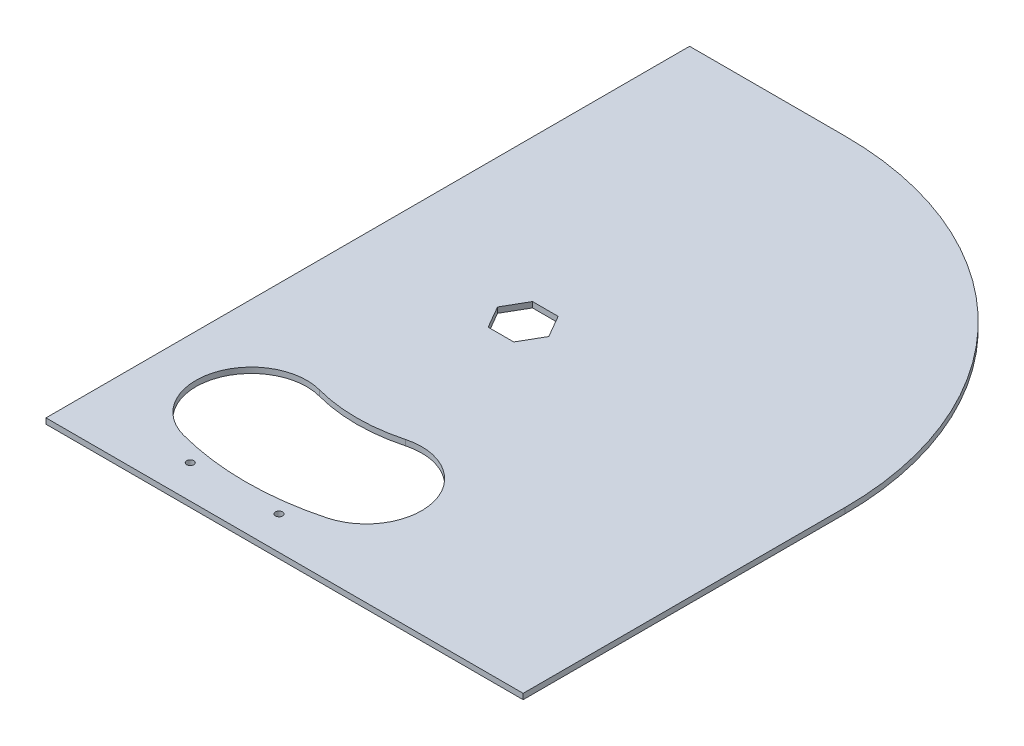
ISO-10303-21;
HEADER;
FILE_DESCRIPTION(('STEP AP214'),'2;1');
FILE_NAME('part.step','',(''),(''),'','','');
FILE_SCHEMA(('AUTOMOTIVE_DESIGN { 1 0 10303 214 1 1 1 1 }'));
ENDSEC;
DATA;
#1=APPLICATION_CONTEXT('core data for automotive mechanical design processes');
#2=APPLICATION_PROTOCOL_DEFINITION('international standard','automotive_design',2000,#1);
#3=PRODUCT_CONTEXT('',#1,'mechanical');
#4=PRODUCT('Part','Part','',(#3));
#5=PRODUCT_RELATED_PRODUCT_CATEGORY('part','',(#4));
#6=PRODUCT_DEFINITION_FORMATION('','',#4);
#7=PRODUCT_DEFINITION_CONTEXT('part definition',#1,'design');
#8=PRODUCT_DEFINITION('design','',#6,#7);
#9=PRODUCT_DEFINITION_SHAPE('','',#8);
#10=(LENGTH_UNIT() NAMED_UNIT(*) SI_UNIT(.MILLI.,.METRE.));
#11=(NAMED_UNIT(*) PLANE_ANGLE_UNIT() SI_UNIT($,.RADIAN.));
#12=(NAMED_UNIT(*) SI_UNIT($,.STERADIAN.) SOLID_ANGLE_UNIT());
#13=UNCERTAINTY_MEASURE_WITH_UNIT(LENGTH_MEASURE(1.E-05),#10,'distance_accuracy_value','');
#14=(GEOMETRIC_REPRESENTATION_CONTEXT(3) GLOBAL_UNCERTAINTY_ASSIGNED_CONTEXT((#13)) GLOBAL_UNIT_ASSIGNED_CONTEXT((#10,
#11,#12)) REPRESENTATION_CONTEXT('',''));
#15=CARTESIAN_POINT('',(0.,0.,0.));
#16=DIRECTION('',(0.,0.,1.));
#17=DIRECTION('',(1.,0.,0.));
#18=AXIS2_PLACEMENT_3D('',#15,#16,#17);
#19=CARTESIAN_POINT('',(0.,2.5,-145.));
#20=DIRECTION('',(0.,-1.,0.));
#21=DIRECTION('',(0.,0.,-1.));
#22=AXIS2_PLACEMENT_3D('',#19,#20,#21);
#23=PLANE('',#22);
#24=CARTESIAN_POINT('',(-20.,2.5,-15.));
#25=DIRECTION('',(0.,1.,0.));
#26=DIRECTION('',(0.,0.,1.));
#27=AXIS2_PLACEMENT_3D('',#24,#25,#26);
#28=CIRCLE('',#27,1.6);
#29=CARTESIAN_POINT('',(-20.,2.5,-13.4));
#30=VERTEX_POINT('',#29);
#31=EDGE_CURVE('E168',#30,#30,#28,.T.);
#32=ORIENTED_EDGE('',*,*,#31,.F.);
#33=EDGE_LOOP('',(#32));
#34=FACE_BOUND('',#33,.T.);
#35=DIRECTION('',(1.,0.,0.));
#36=VECTOR('',#35,1.);
#37=CARTESIAN_POINT('',(-5.77350269189624,2.5,-135.));
#38=LINE('',#37,#36);
#39=CARTESIAN_POINT('',(-5.77350269189624,2.5,-135.));
#40=VERTEX_POINT('',#39);
#41=CARTESIAN_POINT('',(5.77350269189626,2.5,-135.));
#42=VERTEX_POINT('',#41);
#43=EDGE_CURVE('E178',#40,#42,#38,.T.);
#44=ORIENTED_EDGE('',*,*,#43,.F.);
#45=DIRECTION('',(0.5,0.,0.866025403784438));
#46=VECTOR('',#45,1.);
#47=CARTESIAN_POINT('',(-11.5470053837925,2.5,-145.));
#48=LINE('',#47,#46);
#49=CARTESIAN_POINT('',(-11.5470053837925,2.5,-145.));
#50=VERTEX_POINT('',#49);
#51=EDGE_CURVE('E190',#50,#40,#48,.T.);
#52=ORIENTED_EDGE('',*,*,#51,.F.);
#53=DIRECTION('',(-0.5,0.,0.866025403784439));
#54=VECTOR('',#53,1.);
#55=CARTESIAN_POINT('',(-5.77350269189626,2.5,-155.));
#56=LINE('',#55,#54);
#57=CARTESIAN_POINT('',(-5.77350269189626,2.5,-155.));
#58=VERTEX_POINT('',#57);
#59=EDGE_CURVE('E187',#58,#50,#56,.T.);
#60=ORIENTED_EDGE('',*,*,#59,.F.);
#61=DIRECTION('',(-1.,0.,0.));
#62=VECTOR('',#61,1.);
#63=CARTESIAN_POINT('',(5.77350269189625,2.5,-155.));
#64=LINE('',#63,#62);
#65=CARTESIAN_POINT('',(5.77350269189625,2.5,-155.));
#66=VERTEX_POINT('',#65);
#67=EDGE_CURVE('E185',#66,#58,#64,.T.);
#68=ORIENTED_EDGE('',*,*,#67,.F.);
#69=DIRECTION('',(-0.5,0.,-0.866025403784439));
#70=VECTOR('',#69,1.);
#71=CARTESIAN_POINT('',(11.5470053837925,2.5,-145.));
#72=LINE('',#71,#70);
#73=CARTESIAN_POINT('',(11.5470053837925,2.5,-145.));
#74=VERTEX_POINT('',#73);
#75=EDGE_CURVE('E183',#74,#66,#72,.T.);
#76=ORIENTED_EDGE('',*,*,#75,.F.);
#77=DIRECTION('',(0.5,0.,-0.866025403784438));
#78=VECTOR('',#77,1.);
#79=CARTESIAN_POINT('',(5.77350269189626,2.5,-135.));
#80=LINE('',#79,#78);
#81=EDGE_CURVE('E180',#42,#74,#80,.T.);
#82=ORIENTED_EDGE('',*,*,#81,.F.);
#83=EDGE_LOOP('',(#44,#52,#60,#68,#76,#82));
#84=FACE_BOUND('',#83,.T.);
#85=DIRECTION('',(1.,0.,0.));
#86=VECTOR('',#85,1.);
#87=CARTESIAN_POINT('',(145.,2.5,0.));
#88=LINE('',#87,#86);
#89=CARTESIAN_POINT('',(-70.,2.5,0.));
#90=VERTEX_POINT('',#89);
#91=CARTESIAN_POINT('',(145.,2.5,0.));
#92=VERTEX_POINT('',#91);
#93=EDGE_CURVE('E223',#90,#92,#88,.T.);
#94=ORIENTED_EDGE('',*,*,#93,.T.);
#95=DIRECTION('',(0.,0.,-1.));
#96=VECTOR('',#95,1.);
#97=CARTESIAN_POINT('',(145.,2.5,-145.));
#98=LINE('',#97,#96);
#99=CARTESIAN_POINT('',(145.,2.5,-145.));
#100=VERTEX_POINT('',#99);
#101=EDGE_CURVE('E226',#92,#100,#98,.T.);
#102=ORIENTED_EDGE('',*,*,#101,.T.);
#103=CARTESIAN_POINT('',(0.,2.5,-145.));
#104=DIRECTION('',(0.,1.,0.));
#105=DIRECTION('',(0.,0.,-1.));
#106=AXIS2_PLACEMENT_3D('',#103,#104,#105);
#107=CIRCLE('',#106,145.);
#108=CARTESIAN_POINT('',(0.,2.5,-290.));
#109=VERTEX_POINT('',#108);
#110=EDGE_CURVE('E229',#100,#109,#107,.T.);
#111=ORIENTED_EDGE('',*,*,#110,.T.);
#112=DIRECTION('',(-1.,0.,0.));
#113=VECTOR('',#112,1.);
#114=CARTESIAN_POINT('',(0.,2.5,-290.));
#115=LINE('',#114,#113);
#116=CARTESIAN_POINT('',(-70.0000000000001,2.5,-290.));
#117=VERTEX_POINT('',#116);
#118=EDGE_CURVE('E231',#109,#117,#115,.T.);
#119=ORIENTED_EDGE('',*,*,#118,.T.);
#120=DIRECTION('',(0.,0.,1.));
#121=VECTOR('',#120,1.);
#122=CARTESIAN_POINT('',(-70.,2.5,0.));
#123=LINE('',#122,#121);
#124=EDGE_CURVE('E233',#117,#90,#123,.T.);
#125=ORIENTED_EDGE('',*,*,#124,.T.);
#126=EDGE_LOOP('',(#94,#102,#111,#119,#125));
#127=FACE_BOUND('',#126,.T.);
#128=CARTESIAN_POINT('',(-25.8819045102521,2.5,-48.4074173710932));
#129=DIRECTION('',(0.,1.,0.));
#130=DIRECTION('',(0.,0.,1.));
#131=AXIS2_PLACEMENT_3D('',#128,#129,#130);
#132=CIRCLE('',#131,25.);
#133=CARTESIAN_POINT('',(-19.4114283826891,2.5,-72.5555630283199));
#134=VERTEX_POINT('',#133);
#135=CARTESIAN_POINT('',(-32.3523806378152,2.5,-24.2592717138665));
#136=VERTEX_POINT('',#135);
#137=EDGE_CURVE('E139',#134,#136,#132,.T.);
#138=ORIENTED_EDGE('',*,*,#137,.F.);
#139=CARTESIAN_POINT('',(0.,2.5,-145.));
#140=DIRECTION('',(0.,-1.,0.));
#141=DIRECTION('',(0.,0.,1.));
#142=AXIS2_PLACEMENT_3D('',#139,#140,#141);
#143=CIRCLE('',#142,75.);
#144=CARTESIAN_POINT('',(19.4114283826891,2.5,-72.5555630283199));
#145=VERTEX_POINT('',#144);
#146=EDGE_CURVE('E162',#145,#134,#143,.T.);
#147=ORIENTED_EDGE('',*,*,#146,.F.);
#148=CARTESIAN_POINT('',(25.8819045102522,2.5,-48.4074173710932));
#149=DIRECTION('',(0.,1.,0.));
#150=DIRECTION('',(0.,0.,1.));
#151=AXIS2_PLACEMENT_3D('',#148,#149,#150);
#152=CIRCLE('',#151,25.);
#153=CARTESIAN_POINT('',(32.3523806378152,2.5,-24.2592717138665));
#154=VERTEX_POINT('',#153);
#155=EDGE_CURVE('E160',#154,#145,#152,.T.);
#156=ORIENTED_EDGE('',*,*,#155,.F.);
#157=CARTESIAN_POINT('',(0.,2.5,-145.));
#158=DIRECTION('',(0.,1.,0.));
#159=DIRECTION('',(0.,0.,1.));
#160=AXIS2_PLACEMENT_3D('',#157,#158,#159);
#161=CIRCLE('',#160,125.);
#162=EDGE_CURVE('E147',#136,#154,#161,.T.);
#163=ORIENTED_EDGE('',*,*,#162,.F.);
#164=EDGE_LOOP('',(#138,#147,#156,#163));
#165=FACE_BOUND('',#164,.T.);
#166=CARTESIAN_POINT('',(20.,2.5,-15.));
#167=DIRECTION('',(0.,1.,0.));
#168=DIRECTION('',(0.,0.,-1.));
#169=AXIS2_PLACEMENT_3D('',#166,#167,#168);
#170=CIRCLE('',#169,1.6);
#171=CARTESIAN_POINT('',(20.,2.5,-16.6));
#172=VERTEX_POINT('',#171);
#173=EDGE_CURVE('E343',#172,#172,#170,.T.);
#174=ORIENTED_EDGE('',*,*,#173,.F.);
#175=EDGE_LOOP('',(#174));
#176=FACE_BOUND('',#175,.T.);
#177=ADVANCED_FACE('F32',(#34,#84,#127,#165,#176),#23,.F.);
#178=CARTESIAN_POINT('',(0.,0.,-145.));
#179=DIRECTION('',(0.,-1.,0.));
#180=DIRECTION('',(0.,0.,-1.));
#181=AXIS2_PLACEMENT_3D('',#178,#179,#180);
#182=PLANE('',#181);
#183=CARTESIAN_POINT('',(-20.,0.,-15.));
#184=DIRECTION('',(0.,1.,0.));
#185=DIRECTION('',(0.,0.,1.));
#186=AXIS2_PLACEMENT_3D('',#183,#184,#185);
#187=CIRCLE('',#186,1.6);
#188=CARTESIAN_POINT('',(-20.,0.,-13.4));
#189=VERTEX_POINT('',#188);
#190=EDGE_CURVE('E349',#189,#189,#187,.T.);
#191=ORIENTED_EDGE('',*,*,#190,.T.);
#192=EDGE_LOOP('',(#191));
#193=FACE_BOUND('',#192,.T.);
#194=DIRECTION('',(0.5,0.,0.866025403784438));
#195=VECTOR('',#194,1.);
#196=CARTESIAN_POINT('',(-11.5470053837925,0.,-145.));
#197=LINE('',#196,#195);
#198=CARTESIAN_POINT('',(-11.5470053837925,0.,-145.));
#199=VERTEX_POINT('',#198);
#200=CARTESIAN_POINT('',(-5.77350269189623,0.,-135.));
#201=VERTEX_POINT('',#200);
#202=EDGE_CURVE('E181',#199,#201,#197,.T.);
#203=ORIENTED_EDGE('',*,*,#202,.T.);
#204=DIRECTION('',(1.,0.,0.));
#205=VECTOR('',#204,1.);
#206=CARTESIAN_POINT('',(-5.77350269189624,0.,-135.));
#207=LINE('',#206,#205);
#208=CARTESIAN_POINT('',(5.77350269189626,0.,-135.));
#209=VERTEX_POINT('',#208);
#210=EDGE_CURVE('E155',#201,#209,#207,.T.);
#211=ORIENTED_EDGE('',*,*,#210,.T.);
#212=DIRECTION('',(0.5,0.,-0.866025403784438));
#213=VECTOR('',#212,1.);
#214=CARTESIAN_POINT('',(5.77350269189626,0.,-135.));
#215=LINE('',#214,#213);
#216=CARTESIAN_POINT('',(11.5470053837925,0.,-145.));
#217=VERTEX_POINT('',#216);
#218=EDGE_CURVE('E195',#209,#217,#215,.T.);
#219=ORIENTED_EDGE('',*,*,#218,.T.);
#220=DIRECTION('',(-0.5,0.,-0.866025403784439));
#221=VECTOR('',#220,1.);
#222=CARTESIAN_POINT('',(11.5470053837925,0.,-145.));
#223=LINE('',#222,#221);
#224=CARTESIAN_POINT('',(5.77350269189625,0.,-155.));
#225=VERTEX_POINT('',#224);
#226=EDGE_CURVE('E198',#217,#225,#223,.T.);
#227=ORIENTED_EDGE('',*,*,#226,.T.);
#228=DIRECTION('',(-1.,0.,0.));
#229=VECTOR('',#228,1.);
#230=CARTESIAN_POINT('',(5.77350269189625,0.,-155.));
#231=LINE('',#230,#229);
#232=CARTESIAN_POINT('',(-5.77350269189626,0.,-155.));
#233=VERTEX_POINT('',#232);
#234=EDGE_CURVE('E201',#225,#233,#231,.T.);
#235=ORIENTED_EDGE('',*,*,#234,.T.);
#236=DIRECTION('',(-0.5,0.,0.866025403784439));
#237=VECTOR('',#236,1.);
#238=CARTESIAN_POINT('',(-5.77350269189626,0.,-155.));
#239=LINE('',#238,#237);
#240=EDGE_CURVE('E204',#233,#199,#239,.T.);
#241=ORIENTED_EDGE('',*,*,#240,.T.);
#242=EDGE_LOOP('',(#203,#211,#219,#227,#235,#241));
#243=FACE_BOUND('',#242,.T.);
#244=DIRECTION('',(0.,0.,-1.));
#245=VECTOR('',#244,1.);
#246=CARTESIAN_POINT('',(145.,0.,-145.));
#247=LINE('',#246,#245);
#248=CARTESIAN_POINT('',(145.,0.,0.));
#249=VERTEX_POINT('',#248);
#250=CARTESIAN_POINT('',(145.,0.,-145.));
#251=VERTEX_POINT('',#250);
#252=EDGE_CURVE('E222',#249,#251,#247,.T.);
#253=ORIENTED_EDGE('',*,*,#252,.F.);
#254=DIRECTION('',(1.,0.,0.));
#255=VECTOR('',#254,1.);
#256=CARTESIAN_POINT('',(0.,0.,0.));
#257=LINE('',#256,#255);
#258=CARTESIAN_POINT('',(-70.,0.,0.));
#259=VERTEX_POINT('',#258);
#260=EDGE_CURVE('E227',#259,#249,#257,.T.);
#261=ORIENTED_EDGE('',*,*,#260,.F.);
#262=DIRECTION('',(0.,0.,1.));
#263=VECTOR('',#262,1.);
#264=CARTESIAN_POINT('',(-70.,0.,0.));
#265=LINE('',#264,#263);
#266=CARTESIAN_POINT('',(-70.0000000000001,0.,-290.));
#267=VERTEX_POINT('',#266);
#268=EDGE_CURVE('E242',#267,#259,#265,.T.);
#269=ORIENTED_EDGE('',*,*,#268,.F.);
#270=DIRECTION('',(-1.,0.,0.));
#271=VECTOR('',#270,1.);
#272=CARTESIAN_POINT('',(0.,0.,-290.));
#273=LINE('',#272,#271);
#274=CARTESIAN_POINT('',(0.,0.,-290.));
#275=VERTEX_POINT('',#274);
#276=EDGE_CURVE('E240',#275,#267,#273,.T.);
#277=ORIENTED_EDGE('',*,*,#276,.F.);
#278=CARTESIAN_POINT('',(0.,0.,-145.));
#279=DIRECTION('',(0.,1.,0.));
#280=DIRECTION('',(0.,0.,-1.));
#281=AXIS2_PLACEMENT_3D('',#278,#279,#280);
#282=CIRCLE('',#281,145.);
#283=EDGE_CURVE('E238',#251,#275,#282,.T.);
#284=ORIENTED_EDGE('',*,*,#283,.F.);
#285=EDGE_LOOP('',(#253,#261,#269,#277,#284));
#286=FACE_BOUND('',#285,.T.);
#287=CARTESIAN_POINT('',(0.,0.,-145.));
#288=DIRECTION('',(0.,-1.,0.));
#289=DIRECTION('',(0.,0.,1.));
#290=AXIS2_PLACEMENT_3D('',#287,#288,#289);
#291=CIRCLE('',#290,75.);
#292=CARTESIAN_POINT('',(19.4114283826891,0.,-72.5555630283199));
#293=VERTEX_POINT('',#292);
#294=CARTESIAN_POINT('',(-19.4114283826891,0.,-72.5555630283199));
#295=VERTEX_POINT('',#294);
#296=EDGE_CURVE('E148',#293,#295,#291,.T.);
#297=ORIENTED_EDGE('',*,*,#296,.T.);
#298=CARTESIAN_POINT('',(-25.8819045102521,0.,-48.4074173710932));
#299=DIRECTION('',(0.,1.,0.));
#300=DIRECTION('',(0.,0.,1.));
#301=AXIS2_PLACEMENT_3D('',#298,#299,#300);
#302=CIRCLE('',#301,25.);
#303=CARTESIAN_POINT('',(-32.3523806378152,0.,-24.2592717138665));
#304=VERTEX_POINT('',#303);
#305=EDGE_CURVE('E55',#295,#304,#302,.T.);
#306=ORIENTED_EDGE('',*,*,#305,.T.);
#307=CARTESIAN_POINT('',(0.,0.,-145.));
#308=DIRECTION('',(0.,1.,0.));
#309=DIRECTION('',(0.,0.,1.));
#310=AXIS2_PLACEMENT_3D('',#307,#308,#309);
#311=CIRCLE('',#310,125.);
#312=CARTESIAN_POINT('',(32.3523806378152,0.,-24.2592717138665));
#313=VERTEX_POINT('',#312);
#314=EDGE_CURVE('E154',#304,#313,#311,.T.);
#315=ORIENTED_EDGE('',*,*,#314,.T.);
#316=CARTESIAN_POINT('',(25.8819045102522,0.,-48.4074173710932));
#317=DIRECTION('',(0.,1.,0.));
#318=DIRECTION('',(0.,0.,1.));
#319=AXIS2_PLACEMENT_3D('',#316,#317,#318);
#320=CIRCLE('',#319,25.);
#321=EDGE_CURVE('E170',#313,#293,#320,.T.);
#322=ORIENTED_EDGE('',*,*,#321,.T.);
#323=EDGE_LOOP('',(#297,#306,#315,#322));
#324=FACE_BOUND('',#323,.T.);
#325=CARTESIAN_POINT('',(20.,0.,-15.));
#326=DIRECTION('',(0.,1.,0.));
#327=DIRECTION('',(0.,0.,-1.));
#328=AXIS2_PLACEMENT_3D('',#325,#326,#327);
#329=CIRCLE('',#328,1.6);
#330=CARTESIAN_POINT('',(20.,0.,-16.6));
#331=VERTEX_POINT('',#330);
#332=EDGE_CURVE('E346',#331,#331,#329,.T.);
#333=ORIENTED_EDGE('',*,*,#332,.T.);
#334=EDGE_LOOP('',(#333));
#335=FACE_BOUND('',#334,.T.);
#336=ADVANCED_FACE('F263',(#193,#243,#286,#324,#335),#182,.T.);
#337=CARTESIAN_POINT('',(145.,2.5,-145.));
#338=DIRECTION('',(-1.,0.,0.));
#339=DIRECTION('',(0.,0.,1.));
#340=AXIS2_PLACEMENT_3D('',#337,#338,#339);
#341=PLANE('',#340);
#342=ORIENTED_EDGE('',*,*,#252,.T.);
#343=DIRECTION('',(0.,-1.,0.));
#344=VECTOR('',#343,1.);
#345=CARTESIAN_POINT('',(145.,2.5,-145.));
#346=LINE('',#345,#344);
#347=EDGE_CURVE('E40',#100,#251,#346,.T.);
#348=ORIENTED_EDGE('',*,*,#347,.F.);
#349=ORIENTED_EDGE('',*,*,#101,.F.);
#350=DIRECTION('',(0.,-1.,0.));
#351=VECTOR('',#350,1.);
#352=CARTESIAN_POINT('',(145.,2.5,0.));
#353=LINE('',#352,#351);
#354=EDGE_CURVE('E11',#92,#249,#353,.T.);
#355=ORIENTED_EDGE('',*,*,#354,.T.);
#356=EDGE_LOOP('',(#342,#348,#349,#355));
#357=FACE_BOUND('',#356,.T.);
#358=ADVANCED_FACE('F34',(#357),#341,.F.);
#359=CARTESIAN_POINT('',(0.,2.5,-145.));
#360=DIRECTION('',(0.,-1.,0.));
#361=DIRECTION('',(0.,0.,-1.));
#362=AXIS2_PLACEMENT_3D('',#359,#360,#361);
#363=CYLINDRICAL_SURFACE('',#362,145.);
#364=ORIENTED_EDGE('',*,*,#283,.T.);
#365=DIRECTION('',(0.,-1.,0.));
#366=VECTOR('',#365,1.);
#367=CARTESIAN_POINT('',(0.,2.5,-290.));
#368=LINE('',#367,#366);
#369=EDGE_CURVE('E250',#109,#275,#368,.T.);
#370=ORIENTED_EDGE('',*,*,#369,.F.);
#371=ORIENTED_EDGE('',*,*,#110,.F.);
#372=ORIENTED_EDGE('',*,*,#347,.T.);
#373=EDGE_LOOP('',(#364,#370,#371,#372));
#374=FACE_BOUND('',#373,.T.);
#375=ADVANCED_FACE('F257',(#374),#363,.T.);
#376=CARTESIAN_POINT('',(0.,2.5,-290.));
#377=DIRECTION('',(0.,0.,1.));
#378=DIRECTION('',(1.,0.,0.));
#379=AXIS2_PLACEMENT_3D('',#376,#377,#378);
#380=PLANE('',#379);
#381=ORIENTED_EDGE('',*,*,#276,.T.);
#382=DIRECTION('',(0.,-1.,0.));
#383=VECTOR('',#382,1.);
#384=CARTESIAN_POINT('',(-70.0000000000001,2.5,-290.));
#385=LINE('',#384,#383);
#386=EDGE_CURVE('E247',#117,#267,#385,.T.);
#387=ORIENTED_EDGE('',*,*,#386,.F.);
#388=ORIENTED_EDGE('',*,*,#118,.F.);
#389=ORIENTED_EDGE('',*,*,#369,.T.);
#390=EDGE_LOOP('',(#381,#387,#388,#389));
#391=FACE_BOUND('',#390,.T.);
#392=ADVANCED_FACE('F269',(#391),#380,.F.);
#393=CARTESIAN_POINT('',(-70.,2.5,0.));
#394=DIRECTION('',(1.,0.,0.));
#395=DIRECTION('',(0.,0.,-1.));
#396=AXIS2_PLACEMENT_3D('',#393,#394,#395);
#397=PLANE('',#396);
#398=ORIENTED_EDGE('',*,*,#268,.T.);
#399=DIRECTION('',(0.,-1.,0.));
#400=VECTOR('',#399,1.);
#401=CARTESIAN_POINT('',(-70.,2.5,0.));
#402=LINE('',#401,#400);
#403=EDGE_CURVE('E236',#90,#259,#402,.T.);
#404=ORIENTED_EDGE('',*,*,#403,.F.);
#405=ORIENTED_EDGE('',*,*,#124,.F.);
#406=ORIENTED_EDGE('',*,*,#386,.T.);
#407=EDGE_LOOP('',(#398,#404,#405,#406));
#408=FACE_BOUND('',#407,.T.);
#409=ADVANCED_FACE('F273',(#408),#397,.F.);
#410=CARTESIAN_POINT('',(0.,2.5,0.));
#411=DIRECTION('',(0.,0.,-1.));
#412=DIRECTION('',(-1.,0.,0.));
#413=AXIS2_PLACEMENT_3D('',#410,#411,#412);
#414=PLANE('',#413);
#415=ORIENTED_EDGE('',*,*,#260,.T.);
#416=ORIENTED_EDGE('',*,*,#354,.F.);
#417=ORIENTED_EDGE('',*,*,#93,.F.);
#418=ORIENTED_EDGE('',*,*,#403,.T.);
#419=EDGE_LOOP('',(#415,#416,#417,#418));
#420=FACE_BOUND('',#419,.T.);
#421=ADVANCED_FACE('F278',(#420),#414,.F.);
#422=CARTESIAN_POINT('',(-5.77350269189624,2.5,-135.));
#423=DIRECTION('',(0.,0.,-1.));
#424=DIRECTION('',(-1.,0.,0.));
#425=AXIS2_PLACEMENT_3D('',#422,#423,#424);
#426=PLANE('',#425);
#427=ORIENTED_EDGE('',*,*,#210,.F.);
#428=DIRECTION('',(0.,-1.,0.));
#429=VECTOR('',#428,1.);
#430=CARTESIAN_POINT('',(-5.77350269189624,2.5,-135.));
#431=LINE('',#430,#429);
#432=EDGE_CURVE('E192',#40,#201,#431,.T.);
#433=ORIENTED_EDGE('',*,*,#432,.F.);
#434=ORIENTED_EDGE('',*,*,#43,.T.);
#435=DIRECTION('',(0.,-1.,0.));
#436=VECTOR('',#435,1.);
#437=CARTESIAN_POINT('',(5.77350269189626,2.5,-135.));
#438=LINE('',#437,#436);
#439=EDGE_CURVE('E219',#42,#209,#438,.T.);
#440=ORIENTED_EDGE('',*,*,#439,.T.);
#441=EDGE_LOOP('',(#427,#433,#434,#440));
#442=FACE_BOUND('',#441,.T.);
#443=ADVANCED_FACE('F280',(#442),#426,.T.);
#444=CARTESIAN_POINT('',(5.77350269189626,2.5,-135.));
#445=DIRECTION('',(-0.866025403784438,0.,-0.5));
#446=DIRECTION('',(-0.5,0.,0.866025403784438));
#447=AXIS2_PLACEMENT_3D('',#444,#445,#446);
#448=PLANE('',#447);
#449=ORIENTED_EDGE('',*,*,#218,.F.);
#450=ORIENTED_EDGE('',*,*,#439,.F.);
#451=ORIENTED_EDGE('',*,*,#81,.T.);
#452=DIRECTION('',(0.,-1.,0.));
#453=VECTOR('',#452,1.);
#454=CARTESIAN_POINT('',(11.5470053837925,2.5,-145.));
#455=LINE('',#454,#453);
#456=EDGE_CURVE('E217',#74,#217,#455,.T.);
#457=ORIENTED_EDGE('',*,*,#456,.T.);
#458=EDGE_LOOP('',(#449,#450,#451,#457));
#459=FACE_BOUND('',#458,.T.);
#460=ADVANCED_FACE('F286',(#459),#448,.T.);
#461=CARTESIAN_POINT('',(11.5470053837925,2.5,-145.));
#462=DIRECTION('',(-0.866025403784439,0.,0.5));
#463=DIRECTION('',(0.5,0.,0.866025403784439));
#464=AXIS2_PLACEMENT_3D('',#461,#462,#463);
#465=PLANE('',#464);
#466=ORIENTED_EDGE('',*,*,#226,.F.);
#467=ORIENTED_EDGE('',*,*,#456,.F.);
#468=ORIENTED_EDGE('',*,*,#75,.T.);
#469=DIRECTION('',(0.,-1.,0.));
#470=VECTOR('',#469,1.);
#471=CARTESIAN_POINT('',(5.77350269189625,2.5,-155.));
#472=LINE('',#471,#470);
#473=EDGE_CURVE('E215',#66,#225,#472,.T.);
#474=ORIENTED_EDGE('',*,*,#473,.T.);
#475=EDGE_LOOP('',(#466,#467,#468,#474));
#476=FACE_BOUND('',#475,.T.);
#477=ADVANCED_FACE('F303',(#476),#465,.T.);
#478=CARTESIAN_POINT('',(5.77350269189625,2.5,-155.));
#479=DIRECTION('',(0.,0.,1.));
#480=DIRECTION('',(1.,0.,0.));
#481=AXIS2_PLACEMENT_3D('',#478,#479,#480);
#482=PLANE('',#481);
#483=ORIENTED_EDGE('',*,*,#234,.F.);
#484=ORIENTED_EDGE('',*,*,#473,.F.);
#485=ORIENTED_EDGE('',*,*,#67,.T.);
#486=DIRECTION('',(0.,-1.,0.));
#487=VECTOR('',#486,1.);
#488=CARTESIAN_POINT('',(-5.77350269189626,2.5,-155.));
#489=LINE('',#488,#487);
#490=EDGE_CURVE('E213',#58,#233,#489,.T.);
#491=ORIENTED_EDGE('',*,*,#490,.T.);
#492=EDGE_LOOP('',(#483,#484,#485,#491));
#493=FACE_BOUND('',#492,.T.);
#494=ADVANCED_FACE('F307',(#493),#482,.T.);
#495=CARTESIAN_POINT('',(-5.77350269189626,2.5,-155.));
#496=DIRECTION('',(0.866025403784439,0.,0.5));
#497=DIRECTION('',(0.5,0.,-0.866025403784439));
#498=AXIS2_PLACEMENT_3D('',#495,#496,#497);
#499=PLANE('',#498);
#500=ORIENTED_EDGE('',*,*,#240,.F.);
#501=ORIENTED_EDGE('',*,*,#490,.F.);
#502=ORIENTED_EDGE('',*,*,#59,.T.);
#503=DIRECTION('',(0.,-1.,0.));
#504=VECTOR('',#503,1.);
#505=CARTESIAN_POINT('',(-11.5470053837925,2.5,-145.));
#506=LINE('',#505,#504);
#507=EDGE_CURVE('E211',#50,#199,#506,.T.);
#508=ORIENTED_EDGE('',*,*,#507,.T.);
#509=EDGE_LOOP('',(#500,#501,#502,#508));
#510=FACE_BOUND('',#509,.T.);
#511=ADVANCED_FACE('F311',(#510),#499,.T.);
#512=CARTESIAN_POINT('',(-11.5470053837925,2.5,-145.));
#513=DIRECTION('',(0.866025403784439,0.,-0.5));
#514=DIRECTION('',(-0.5,0.,-0.866025403784439));
#515=AXIS2_PLACEMENT_3D('',#512,#513,#514);
#516=PLANE('',#515);
#517=ORIENTED_EDGE('',*,*,#202,.F.);
#518=ORIENTED_EDGE('',*,*,#507,.F.);
#519=ORIENTED_EDGE('',*,*,#51,.T.);
#520=ORIENTED_EDGE('',*,*,#432,.T.);
#521=EDGE_LOOP('',(#517,#518,#519,#520));
#522=FACE_BOUND('',#521,.T.);
#523=ADVANCED_FACE('F315',(#522),#516,.T.);
#524=CARTESIAN_POINT('',(-25.8819045102521,2.5,-48.4074173710932));
#525=DIRECTION('',(0.,-1.,0.));
#526=DIRECTION('',(0.,0.,-1.));
#527=AXIS2_PLACEMENT_3D('',#524,#525,#526);
#528=CYLINDRICAL_SURFACE('',#527,25.);
#529=ORIENTED_EDGE('',*,*,#305,.F.);
#530=DIRECTION('',(0.,-1.,0.));
#531=VECTOR('',#530,1.);
#532=CARTESIAN_POINT('',(-19.4114283826891,2.5,-72.5555630283199));
#533=LINE('',#532,#531);
#534=EDGE_CURVE('E143',#134,#295,#533,.T.);
#535=ORIENTED_EDGE('',*,*,#534,.F.);
#536=ORIENTED_EDGE('',*,*,#137,.T.);
#537=DIRECTION('',(0.,-1.,0.));
#538=VECTOR('',#537,1.);
#539=CARTESIAN_POINT('',(-32.3523806378152,2.5,-24.2592717138665));
#540=LINE('',#539,#538);
#541=EDGE_CURVE('E142',#136,#304,#540,.T.);
#542=ORIENTED_EDGE('',*,*,#541,.T.);
#543=EDGE_LOOP('',(#529,#535,#536,#542));
#544=FACE_BOUND('',#543,.T.);
#545=ADVANCED_FACE('F141',(#544),#528,.F.);
#546=CARTESIAN_POINT('',(0.,2.5,-145.));
#547=DIRECTION('',(0.,-1.,0.));
#548=DIRECTION('',(0.,0.,-1.));
#549=AXIS2_PLACEMENT_3D('',#546,#547,#548);
#550=CYLINDRICAL_SURFACE('',#549,125.);
#551=ORIENTED_EDGE('',*,*,#314,.F.);
#552=ORIENTED_EDGE('',*,*,#541,.F.);
#553=ORIENTED_EDGE('',*,*,#162,.T.);
#554=DIRECTION('',(0.,-1.,0.));
#555=VECTOR('',#554,1.);
#556=CARTESIAN_POINT('',(32.3523806378152,2.5,-24.2592717138665));
#557=LINE('',#556,#555);
#558=EDGE_CURVE('E156',#154,#313,#557,.T.);
#559=ORIENTED_EDGE('',*,*,#558,.T.);
#560=EDGE_LOOP('',(#551,#552,#553,#559));
#561=FACE_BOUND('',#560,.T.);
#562=ADVANCED_FACE('F151',(#561),#550,.F.);
#563=CARTESIAN_POINT('',(25.8819045102522,2.5,-48.4074173710932));
#564=DIRECTION('',(0.,-1.,0.));
#565=DIRECTION('',(0.,0.,-1.));
#566=AXIS2_PLACEMENT_3D('',#563,#564,#565);
#567=CYLINDRICAL_SURFACE('',#566,25.);
#568=ORIENTED_EDGE('',*,*,#321,.F.);
#569=ORIENTED_EDGE('',*,*,#558,.F.);
#570=ORIENTED_EDGE('',*,*,#155,.T.);
#571=DIRECTION('',(0.,-1.,0.));
#572=VECTOR('',#571,1.);
#573=CARTESIAN_POINT('',(19.4114283826891,2.5,-72.5555630283199));
#574=LINE('',#573,#572);
#575=EDGE_CURVE('E47',#145,#293,#574,.T.);
#576=ORIENTED_EDGE('',*,*,#575,.T.);
#577=EDGE_LOOP('',(#568,#569,#570,#576));
#578=FACE_BOUND('',#577,.T.);
#579=ADVANCED_FACE('F324',(#578),#567,.F.);
#580=CARTESIAN_POINT('',(0.,2.5,-145.));
#581=DIRECTION('',(0.,-1.,0.));
#582=DIRECTION('',(0.,0.,-1.));
#583=AXIS2_PLACEMENT_3D('',#580,#581,#582);
#584=CYLINDRICAL_SURFACE('',#583,75.);
#585=ORIENTED_EDGE('',*,*,#296,.F.);
#586=ORIENTED_EDGE('',*,*,#575,.F.);
#587=ORIENTED_EDGE('',*,*,#146,.T.);
#588=ORIENTED_EDGE('',*,*,#534,.T.);
#589=EDGE_LOOP('',(#585,#586,#587,#588));
#590=FACE_BOUND('',#589,.T.);
#591=ADVANCED_FACE('F327',(#590),#584,.T.);
#592=CARTESIAN_POINT('',(-20.,2.5,-15.));
#593=DIRECTION('',(0.,-1.,0.));
#594=DIRECTION('',(0.,0.,-1.));
#595=AXIS2_PLACEMENT_3D('',#592,#593,#594);
#596=CYLINDRICAL_SURFACE('',#595,1.6);
#597=ORIENTED_EDGE('',*,*,#31,.T.);
#598=EDGE_LOOP('',(#597));
#599=FACE_BOUND('',#598,.T.);
#600=ORIENTED_EDGE('',*,*,#190,.F.);
#601=EDGE_LOOP('',(#600));
#602=FACE_BOUND('',#601,.T.);
#603=ADVANCED_FACE('F331',(#599,#602),#596,.F.);
#604=CARTESIAN_POINT('',(20.,2.5,-15.));
#605=DIRECTION('',(0.,-1.,0.));
#606=DIRECTION('',(0.,0.,-1.));
#607=AXIS2_PLACEMENT_3D('',#604,#605,#606);
#608=CYLINDRICAL_SURFACE('',#607,1.6);
#609=ORIENTED_EDGE('',*,*,#173,.T.);
#610=EDGE_LOOP('',(#609));
#611=FACE_BOUND('',#610,.T.);
#612=ORIENTED_EDGE('',*,*,#332,.F.);
#613=EDGE_LOOP('',(#612));
#614=FACE_BOUND('',#613,.T.);
#615=ADVANCED_FACE('F334',(#611,#614),#608,.F.);
#616=CLOSED_SHELL('',(#177,#336,#358,#375,#392,#409,#421,#443,#460,#477,#494,#511,#523,#545,
#562,#579,#591,#603,#615));
#617=MANIFOLD_SOLID_BREP('B2',#616);
#618=ADVANCED_BREP_SHAPE_REPRESENTATION('',(#18,#617),#14);
#619=SHAPE_DEFINITION_REPRESENTATION(#9,#618);
ENDSEC;
END-ISO-10303-21;
